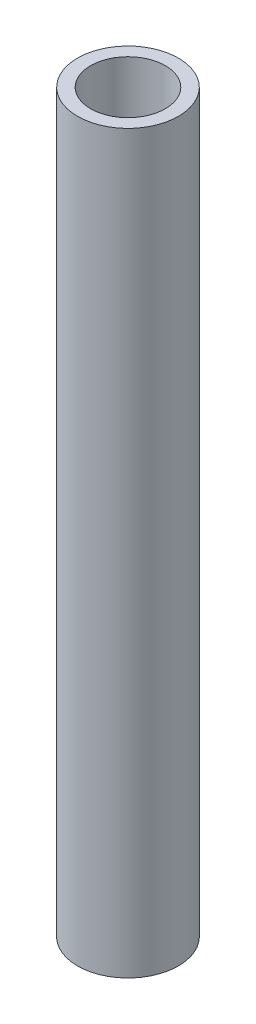
ISO-10303-21;
HEADER;
FILE_DESCRIPTION(('STEP AP214'),'2;1');
FILE_NAME('part.step','',(''),(''),'','','');
FILE_SCHEMA(('AUTOMOTIVE_DESIGN { 1 0 10303 214 1 1 1 1 }'));
ENDSEC;
DATA;
#1=APPLICATION_CONTEXT('core data for automotive mechanical design processes');
#2=APPLICATION_PROTOCOL_DEFINITION('international standard','automotive_design',2000,#1);
#3=PRODUCT_CONTEXT('',#1,'mechanical');
#4=PRODUCT('Part','Part','',(#3));
#5=PRODUCT_RELATED_PRODUCT_CATEGORY('part','',(#4));
#6=PRODUCT_DEFINITION_FORMATION('','',#4);
#7=PRODUCT_DEFINITION_CONTEXT('part definition',#1,'design');
#8=PRODUCT_DEFINITION('design','',#6,#7);
#9=PRODUCT_DEFINITION_SHAPE('','',#8);
#10=(LENGTH_UNIT() NAMED_UNIT(*) SI_UNIT(.MILLI.,.METRE.));
#11=(NAMED_UNIT(*) PLANE_ANGLE_UNIT() SI_UNIT($,.RADIAN.));
#12=(NAMED_UNIT(*) SI_UNIT($,.STERADIAN.) SOLID_ANGLE_UNIT());
#13=UNCERTAINTY_MEASURE_WITH_UNIT(LENGTH_MEASURE(1.E-05),#10,'distance_accuracy_value','');
#14=(GEOMETRIC_REPRESENTATION_CONTEXT(3) GLOBAL_UNCERTAINTY_ASSIGNED_CONTEXT((#13)) GLOBAL_UNIT_ASSIGNED_CONTEXT((#10,
#11,#12)) REPRESENTATION_CONTEXT('',''));
#15=CARTESIAN_POINT('',(0.,0.,0.));
#16=DIRECTION('',(0.,0.,1.));
#17=DIRECTION('',(1.,0.,0.));
#18=AXIS2_PLACEMENT_3D('',#15,#16,#17);
#19=CARTESIAN_POINT('',(0.,155.575,0.));
#20=DIRECTION('',(0.,1.,0.));
#21=DIRECTION('',(0.,0.,1.));
#22=AXIS2_PLACEMENT_3D('',#19,#20,#21);
#23=PLANE('',#22);
#24=CARTESIAN_POINT('',(0.,155.575,0.));
#25=DIRECTION('',(0.,1.,0.));
#26=DIRECTION('',(0.,0.,1.));
#27=AXIS2_PLACEMENT_3D('',#24,#25,#26);
#28=CIRCLE('',#27,10.668);
#29=CARTESIAN_POINT('',(0.,155.575,10.668));
#30=VERTEX_POINT('',#29);
#31=EDGE_CURVE('E10',#30,#30,#28,.T.);
#32=ORIENTED_EDGE('',*,*,#31,.T.);
#33=EDGE_LOOP('',(#32));
#34=FACE_BOUND('',#33,.T.);
#35=CARTESIAN_POINT('',(0.,155.575,0.));
#36=DIRECTION('',(0.,1.,0.));
#37=DIRECTION('',(0.,0.,1.));
#38=AXIS2_PLACEMENT_3D('',#35,#36,#37);
#39=CIRCLE('',#38,7.8994);
#40=CARTESIAN_POINT('',(0.,155.575,7.8994));
#41=VERTEX_POINT('',#40);
#42=EDGE_CURVE('E42',#41,#41,#39,.T.);
#43=ORIENTED_EDGE('',*,*,#42,.F.);
#44=EDGE_LOOP('',(#43));
#45=FACE_BOUND('',#44,.T.);
#46=ADVANCED_FACE('F31',(#34,#45),#23,.T.);
#47=CARTESIAN_POINT('',(0.,0.,0.));
#48=DIRECTION('',(0.,1.,0.));
#49=DIRECTION('',(0.,0.,1.));
#50=AXIS2_PLACEMENT_3D('',#47,#48,#49);
#51=PLANE('',#50);
#52=CARTESIAN_POINT('',(0.,0.,0.));
#53=DIRECTION('',(0.,1.,0.));
#54=DIRECTION('',(0.,0.,1.));
#55=AXIS2_PLACEMENT_3D('',#52,#53,#54);
#56=CIRCLE('',#55,10.668);
#57=CARTESIAN_POINT('',(0.,0.,10.668));
#58=VERTEX_POINT('',#57);
#59=EDGE_CURVE('E35',#58,#58,#56,.T.);
#60=ORIENTED_EDGE('',*,*,#59,.F.);
#61=EDGE_LOOP('',(#60));
#62=FACE_BOUND('',#61,.T.);
#63=CARTESIAN_POINT('',(0.,0.,0.));
#64=DIRECTION('',(0.,1.,0.));
#65=DIRECTION('',(0.,0.,1.));
#66=AXIS2_PLACEMENT_3D('',#63,#64,#65);
#67=CIRCLE('',#66,7.8994);
#68=CARTESIAN_POINT('',(0.,0.,7.8994));
#69=VERTEX_POINT('',#68);
#70=EDGE_CURVE('E44',#69,#69,#67,.T.);
#71=ORIENTED_EDGE('',*,*,#70,.T.);
#72=EDGE_LOOP('',(#71));
#73=FACE_BOUND('',#72,.T.);
#74=ADVANCED_FACE('F54',(#62,#73),#51,.F.);
#75=CARTESIAN_POINT('',(0.,155.575,0.));
#76=DIRECTION('',(0.,-1.,0.));
#77=DIRECTION('',(0.,0.,-1.));
#78=AXIS2_PLACEMENT_3D('',#75,#76,#77);
#79=CYLINDRICAL_SURFACE('',#78,10.668);
#80=ORIENTED_EDGE('',*,*,#31,.F.);
#81=EDGE_LOOP('',(#80));
#82=FACE_BOUND('',#81,.T.);
#83=ORIENTED_EDGE('',*,*,#59,.T.);
#84=EDGE_LOOP('',(#83));
#85=FACE_BOUND('',#84,.T.);
#86=ADVANCED_FACE('F33',(#82,#85),#79,.T.);
#87=CARTESIAN_POINT('',(0.,155.575,0.));
#88=DIRECTION('',(0.,-1.,0.));
#89=DIRECTION('',(0.,0.,-1.));
#90=AXIS2_PLACEMENT_3D('',#87,#88,#89);
#91=CYLINDRICAL_SURFACE('',#90,7.8994);
#92=ORIENTED_EDGE('',*,*,#42,.T.);
#93=EDGE_LOOP('',(#92));
#94=FACE_BOUND('',#93,.T.);
#95=ORIENTED_EDGE('',*,*,#70,.F.);
#96=EDGE_LOOP('',(#95));
#97=FACE_BOUND('',#96,.T.);
#98=ADVANCED_FACE('F50',(#94,#97),#91,.F.);
#99=CLOSED_SHELL('',(#46,#74,#86,#98));
#100=MANIFOLD_SOLID_BREP('B2',#99);
#101=ADVANCED_BREP_SHAPE_REPRESENTATION('',(#18,#100),#14);
#102=SHAPE_DEFINITION_REPRESENTATION(#9,#101);
ENDSEC;
END-ISO-10303-21;
